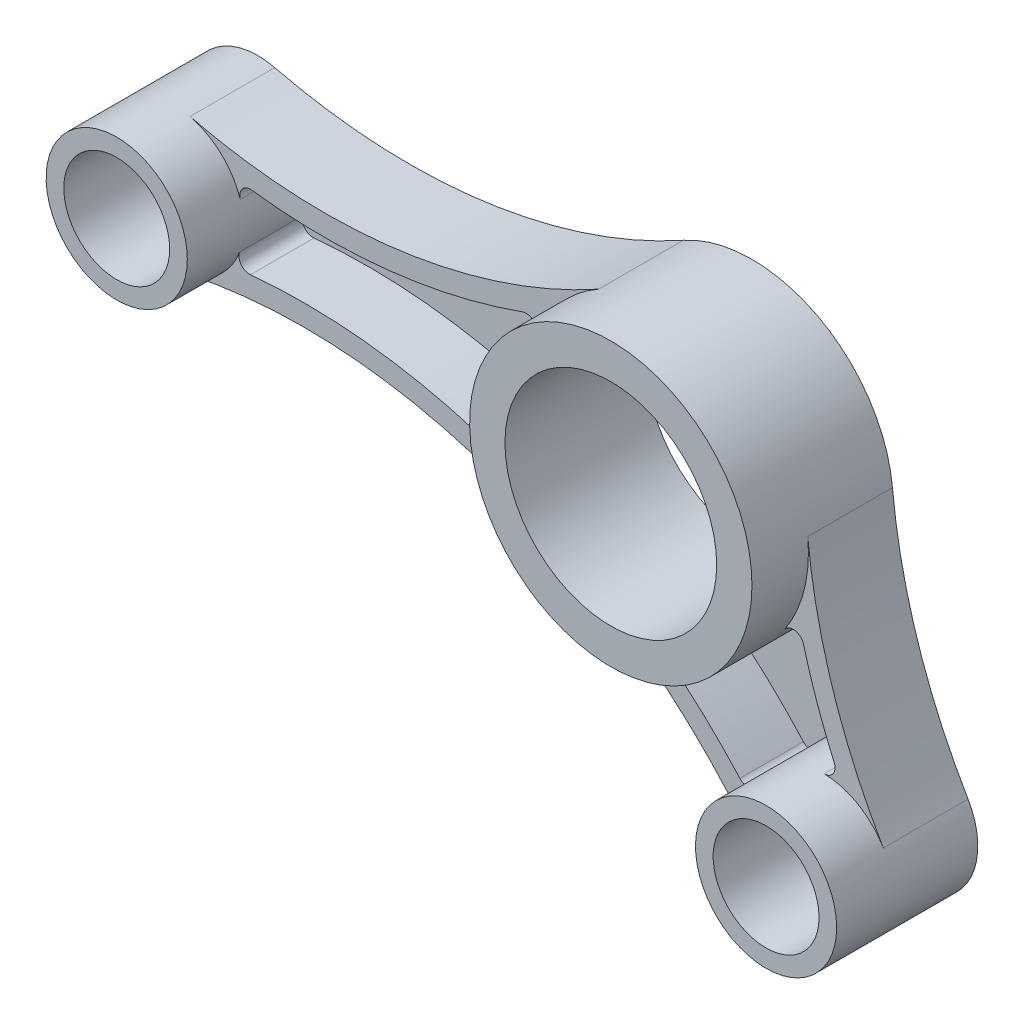
ISO-10303-21;
HEADER;
FILE_DESCRIPTION(('STEP AP214'),'2;1');
FILE_NAME('part.step','',(''),(''),'','','');
FILE_SCHEMA(('AUTOMOTIVE_DESIGN { 1 0 10303 214 1 1 1 1 }'));
ENDSEC;
DATA;
#1=APPLICATION_CONTEXT('core data for automotive mechanical design processes');
#2=APPLICATION_PROTOCOL_DEFINITION('international standard','automotive_design',2000,#1);
#3=PRODUCT_CONTEXT('',#1,'mechanical');
#4=PRODUCT('Part','Part','',(#3));
#5=PRODUCT_RELATED_PRODUCT_CATEGORY('part','',(#4));
#6=PRODUCT_DEFINITION_FORMATION('','',#4);
#7=PRODUCT_DEFINITION_CONTEXT('part definition',#1,'design');
#8=PRODUCT_DEFINITION('design','',#6,#7);
#9=PRODUCT_DEFINITION_SHAPE('','',#8);
#10=(LENGTH_UNIT() NAMED_UNIT(*) SI_UNIT(.MILLI.,.METRE.));
#11=(NAMED_UNIT(*) PLANE_ANGLE_UNIT() SI_UNIT($,.RADIAN.));
#12=(NAMED_UNIT(*) SI_UNIT($,.STERADIAN.) SOLID_ANGLE_UNIT());
#13=UNCERTAINTY_MEASURE_WITH_UNIT(LENGTH_MEASURE(1.E-05),#10,'distance_accuracy_value','');
#14=(GEOMETRIC_REPRESENTATION_CONTEXT(3) GLOBAL_UNCERTAINTY_ASSIGNED_CONTEXT((#13)) GLOBAL_UNIT_ASSIGNED_CONTEXT((#10,
#11,#12)) REPRESENTATION_CONTEXT('',''));
#15=CARTESIAN_POINT('',(0.,0.,0.));
#16=DIRECTION('',(0.,0.,1.));
#17=DIRECTION('',(1.,0.,0.));
#18=AXIS2_PLACEMENT_3D('',#15,#16,#17);
#19=CARTESIAN_POINT('',(0.,0.,20.));
#20=DIRECTION('',(0.,0.,-1.));
#21=DIRECTION('',(-1.,0.,0.));
#22=AXIS2_PLACEMENT_3D('',#19,#20,#21);
#23=CYLINDRICAL_SURFACE('',#22,20.);
#24=CARTESIAN_POINT('',(0.,0.,20.));
#25=DIRECTION('',(0.,0.,1.));
#26=DIRECTION('',(1.,0.,0.));
#27=AXIS2_PLACEMENT_3D('',#24,#25,#26);
#28=CIRCLE('',#27,20.);
#29=CARTESIAN_POINT('',(20.,0.,20.));
#30=VERTEX_POINT('',#29);
#31=EDGE_CURVE('E204',#30,#30,#28,.T.);
#32=ORIENTED_EDGE('',*,*,#31,.F.);
#33=EDGE_LOOP('',(#32));
#34=FACE_BOUND('',#33,.T.);
#35=CARTESIAN_POINT('',(0.,0.,12.));
#36=DIRECTION('',(0.,0.,1.));
#37=DIRECTION('',(1.,0.,0.));
#38=AXIS2_PLACEMENT_3D('',#35,#36,#37);
#39=CIRCLE('',#38,20.);
#40=CARTESIAN_POINT('',(-17.6980518463071,-9.31552257500485,12.));
#41=VERTEX_POINT('',#40);
#42=CARTESIAN_POINT('',(0.586906535940655,-19.9913866632125,12.));
#43=VERTEX_POINT('',#42);
#44=EDGE_CURVE('E251',#41,#43,#39,.T.);
#45=ORIENTED_EDGE('',*,*,#44,.T.);
#46=DIRECTION('',(0.,0.,-1.));
#47=VECTOR('',#46,1.);
#48=CARTESIAN_POINT('',(0.586906535940655,-19.9913866632125,20.));
#49=LINE('',#48,#47);
#50=CARTESIAN_POINT('',(0.586906535940655,-19.9913866632125,3.));
#51=VERTEX_POINT('',#50);
#52=EDGE_CURVE('E375',#43,#51,#49,.T.);
#53=ORIENTED_EDGE('',*,*,#52,.T.);
#54=CARTESIAN_POINT('',(0.,0.,3.));
#55=DIRECTION('',(0.,0.,1.));
#56=DIRECTION('',(1.,0.,0.));
#57=AXIS2_PLACEMENT_3D('',#54,#55,#56);
#58=CIRCLE('',#57,20.);
#59=CARTESIAN_POINT('',(16.6113412774827,-11.1383724557495,3.));
#60=VERTEX_POINT('',#59);
#61=EDGE_CURVE('E503',#51,#60,#58,.T.);
#62=ORIENTED_EDGE('',*,*,#61,.T.);
#63=DIRECTION('',(0.,0.,-1.));
#64=VECTOR('',#63,1.);
#65=CARTESIAN_POINT('',(16.6113412774827,-11.1383724557495,20.));
#66=LINE('',#65,#64);
#67=CARTESIAN_POINT('',(16.6113412774827,-11.1383724557495,12.));
#68=VERTEX_POINT('',#67);
#69=EDGE_CURVE('E372',#60,#68,#66,.F.);
#70=ORIENTED_EDGE('',*,*,#69,.T.);
#71=CARTESIAN_POINT('',(0.,0.,12.));
#72=DIRECTION('',(0.,0.,1.));
#73=DIRECTION('',(1.,0.,0.));
#74=AXIS2_PLACEMENT_3D('',#71,#72,#73);
#75=CIRCLE('',#74,20.);
#76=CARTESIAN_POINT('',(19.9054700055019,1.94223167002899,12.));
#77=VERTEX_POINT('',#76);
#78=EDGE_CURVE('E210',#68,#77,#75,.T.);
#79=ORIENTED_EDGE('',*,*,#78,.T.);
#80=DIRECTION('',(0.,0.,-1.));
#81=VECTOR('',#80,1.);
#82=CARTESIAN_POINT('',(19.9054700055019,1.94223167002899,12.));
#83=LINE('',#82,#81);
#84=CARTESIAN_POINT('',(19.9054700055019,1.94223167002899,0.));
#85=VERTEX_POINT('',#84);
#86=EDGE_CURVE('E208',#77,#85,#83,.T.);
#87=ORIENTED_EDGE('',*,*,#86,.T.);
#88=CARTESIAN_POINT('',(0.,0.,0.));
#89=DIRECTION('',(0.,0.,1.));
#90=DIRECTION('',(1.,0.,0.));
#91=AXIS2_PLACEMENT_3D('',#88,#89,#90);
#92=CIRCLE('',#91,20.);
#93=CARTESIAN_POINT('',(-9.71428571428572,17.4823526180324,0.));
#94=VERTEX_POINT('',#93);
#95=EDGE_CURVE('E191',#85,#94,#92,.T.);
#96=ORIENTED_EDGE('',*,*,#95,.T.);
#97=DIRECTION('',(0.,0.,-1.));
#98=VECTOR('',#97,1.);
#99=CARTESIAN_POINT('',(-9.71428571428572,17.4823526180324,12.));
#100=LINE('',#99,#98);
#101=CARTESIAN_POINT('',(-9.71428571428572,17.4823526180324,12.));
#102=VERTEX_POINT('',#101);
#103=EDGE_CURVE('E312',#102,#94,#100,.T.);
#104=ORIENTED_EDGE('',*,*,#103,.F.);
#105=CARTESIAN_POINT('',(0.,0.,12.));
#106=DIRECTION('',(0.,0.,1.));
#107=DIRECTION('',(1.,0.,0.));
#108=AXIS2_PLACEMENT_3D('',#105,#106,#107);
#109=CIRCLE('',#108,20.);
#110=CARTESIAN_POINT('',(-18.6051659208393,7.33810609476582,12.));
#111=VERTEX_POINT('',#110);
#112=EDGE_CURVE('E299',#102,#111,#109,.T.);
#113=ORIENTED_EDGE('',*,*,#112,.T.);
#114=DIRECTION('',(0.,0.,-1.));
#115=VECTOR('',#114,1.);
#116=CARTESIAN_POINT('',(-18.6051659208393,7.33810609476582,20.));
#117=LINE('',#116,#115);
#118=CARTESIAN_POINT('',(-18.6051659208393,7.33810609476582,3.));
#119=VERTEX_POINT('',#118);
#120=EDGE_CURVE('E364',#111,#119,#117,.T.);
#121=ORIENTED_EDGE('',*,*,#120,.T.);
#122=CARTESIAN_POINT('',(0.,0.,3.));
#123=DIRECTION('',(0.,0.,1.));
#124=DIRECTION('',(1.,0.,0.));
#125=AXIS2_PLACEMENT_3D('',#122,#123,#124);
#126=CIRCLE('',#125,20.);
#127=CARTESIAN_POINT('',(-17.6980518463071,-9.31552257500485,3.));
#128=VERTEX_POINT('',#127);
#129=EDGE_CURVE('E463',#119,#128,#126,.T.);
#130=ORIENTED_EDGE('',*,*,#129,.T.);
#131=DIRECTION('',(0.,0.,-1.));
#132=VECTOR('',#131,1.);
#133=CARTESIAN_POINT('',(-17.6980518463071,-9.31552257500485,20.));
#134=LINE('',#133,#132);
#135=EDGE_CURVE('E368',#128,#41,#134,.F.);
#136=ORIENTED_EDGE('',*,*,#135,.T.);
#137=EDGE_LOOP('',(#45,#53,#62,#70,#79,#87,#96,#104,#113,#121,#130,#136));
#138=FACE_BOUND('',#137,.T.);
#139=ADVANCED_FACE('F41',(#34,#138),#23,.T.);
#140=CARTESIAN_POINT('',(22.,-36.,20.));
#141=DIRECTION('',(0.,0.,-1.));
#142=DIRECTION('',(-1.,0.,0.));
#143=AXIS2_PLACEMENT_3D('',#140,#141,#142);
#144=CYLINDRICAL_SURFACE('',#143,10.);
#145=CARTESIAN_POINT('',(22.,-36.,20.));
#146=DIRECTION('',(0.,0.,1.));
#147=DIRECTION('',(1.,0.,0.));
#148=AXIS2_PLACEMENT_3D('',#145,#146,#147);
#149=CIRCLE('',#148,10.);
#150=CARTESIAN_POINT('',(32.,-36.,20.));
#151=VERTEX_POINT('',#150);
#152=EDGE_CURVE('E235',#151,#151,#149,.T.);
#153=ORIENTED_EDGE('',*,*,#152,.F.);
#154=EDGE_LOOP('',(#153));
#155=FACE_BOUND('',#154,.T.);
#156=CARTESIAN_POINT('',(22.,-36.,3.));
#157=DIRECTION('',(0.,0.,1.));
#158=DIRECTION('',(1.,0.,0.));
#159=AXIS2_PLACEMENT_3D('',#156,#157,#158);
#160=CIRCLE('',#159,10.);
#161=CARTESIAN_POINT('',(22.2294855530443,-26.0026335277262,3.));
#162=VERTEX_POINT('',#161);
#163=CARTESIAN_POINT('',(12.7826897810462,-32.1217023931151,3.));
#164=VERTEX_POINT('',#163);
#165=EDGE_CURVE('E471',#162,#164,#160,.T.);
#166=ORIENTED_EDGE('',*,*,#165,.T.);
#167=DIRECTION('',(0.,0.,-1.));
#168=VECTOR('',#167,1.);
#169=CARTESIAN_POINT('',(12.7826897810462,-32.1217023931151,20.));
#170=LINE('',#169,#168);
#171=CARTESIAN_POINT('',(12.7826897810462,-32.1217023931151,12.));
#172=VERTEX_POINT('',#171);
#173=EDGE_CURVE('E353',#164,#172,#170,.F.);
#174=ORIENTED_EDGE('',*,*,#173,.T.);
#175=CARTESIAN_POINT('',(22.,-36.,12.));
#176=DIRECTION('',(0.,0.,1.));
#177=DIRECTION('',(1.,0.,0.));
#178=AXIS2_PLACEMENT_3D('',#175,#176,#177);
#179=CIRCLE('',#178,10.);
#180=CARTESIAN_POINT('',(13.8427949105964,-41.7844623889699,12.));
#181=VERTEX_POINT('',#180);
#182=EDGE_CURVE('E264',#172,#181,#179,.T.);
#183=ORIENTED_EDGE('',*,*,#182,.T.);
#184=DIRECTION('',(0.,0.,-1.));
#185=VECTOR('',#184,1.);
#186=CARTESIAN_POINT('',(13.8427949105963,-41.7844623889699,12.));
#187=LINE('',#186,#185);
#188=CARTESIAN_POINT('',(13.8427949105963,-41.7844623889699,0.));
#189=VERTEX_POINT('',#188);
#190=EDGE_CURVE('E272',#181,#189,#187,.T.);
#191=ORIENTED_EDGE('',*,*,#190,.T.);
#192=CARTESIAN_POINT('',(22.,-36.,0.));
#193=DIRECTION('',(0.,0.,1.));
#194=DIRECTION('',(1.,0.,0.));
#195=AXIS2_PLACEMENT_3D('',#192,#193,#194);
#196=CIRCLE('',#195,10.);
#197=CARTESIAN_POINT('',(30.6141500030566,-30.9209824055395,0.));
#198=VERTEX_POINT('',#197);
#199=EDGE_CURVE('E236',#189,#198,#196,.T.);
#200=ORIENTED_EDGE('',*,*,#199,.T.);
#201=DIRECTION('',(0.,0.,-1.));
#202=VECTOR('',#201,1.);
#203=CARTESIAN_POINT('',(30.6141500030566,-30.9209824055395,12.));
#204=LINE('',#203,#202);
#205=CARTESIAN_POINT('',(30.6141500030566,-30.9209824055395,12.));
#206=VERTEX_POINT('',#205);
#207=EDGE_CURVE('E215',#206,#198,#204,.T.);
#208=ORIENTED_EDGE('',*,*,#207,.F.);
#209=CARTESIAN_POINT('',(22.,-36.,12.));
#210=DIRECTION('',(0.,0.,1.));
#211=DIRECTION('',(1.,0.,0.));
#212=AXIS2_PLACEMENT_3D('',#209,#210,#211);
#213=CIRCLE('',#212,10.);
#214=CARTESIAN_POINT('',(22.2294855530443,-26.0026335277262,12.));
#215=VERTEX_POINT('',#214);
#216=EDGE_CURVE('E477',#206,#215,#213,.T.);
#217=ORIENTED_EDGE('',*,*,#216,.T.);
#218=DIRECTION('',(0.,0.,-1.));
#219=VECTOR('',#218,1.);
#220=CARTESIAN_POINT('',(22.2294855530443,-26.0026335277262,20.));
#221=LINE('',#220,#219);
#222=EDGE_CURVE('E349',#215,#162,#221,.T.);
#223=ORIENTED_EDGE('',*,*,#222,.T.);
#224=EDGE_LOOP('',(#166,#174,#183,#191,#200,#208,#217,#223));
#225=FACE_BOUND('',#224,.T.);
#226=ADVANCED_FACE('F492',(#155,#225),#144,.T.);
#227=CARTESIAN_POINT('',(-70.,0.,20.));
#228=DIRECTION('',(0.,0.,-1.));
#229=DIRECTION('',(-1.,0.,0.));
#230=AXIS2_PLACEMENT_3D('',#227,#228,#229);
#231=CYLINDRICAL_SURFACE('',#230,9.99999999999999);
#232=CARTESIAN_POINT('',(-70.,0.,20.));
#233=DIRECTION('',(0.,0.,1.));
#234=DIRECTION('',(1.,0.,0.));
#235=AXIS2_PLACEMENT_3D('',#232,#233,#234);
#236=CIRCLE('',#235,9.99999999999999);
#237=CARTESIAN_POINT('',(-60.,0.,20.));
#238=VERTEX_POINT('',#237);
#239=EDGE_CURVE('E320',#238,#238,#236,.T.);
#240=ORIENTED_EDGE('',*,*,#239,.F.);
#241=EDGE_LOOP('',(#240));
#242=FACE_BOUND('',#241,.T.);
#243=CARTESIAN_POINT('',(-70.,0.,12.));
#244=DIRECTION('',(0.,0.,1.));
#245=DIRECTION('',(1.,0.,0.));
#246=AXIS2_PLACEMENT_3D('',#243,#244,#245);
#247=CIRCLE('',#246,9.99999999999999);
#248=CARTESIAN_POINT('',(-67.9349828671814,-9.78446238896985,12.));
#249=VERTEX_POINT('',#248);
#250=CARTESIAN_POINT('',(-60.5984095289481,-3.40735918485657,12.));
#251=VERTEX_POINT('',#250);
#252=EDGE_CURVE('E57',#249,#251,#247,.T.);
#253=ORIENTED_EDGE('',*,*,#252,.T.);
#254=DIRECTION('',(0.,0.,-1.));
#255=VECTOR('',#254,1.);
#256=CARTESIAN_POINT('',(-60.5984095289481,-3.40735918485657,20.));
#257=LINE('',#256,#255);
#258=CARTESIAN_POINT('',(-60.5984095289481,-3.40735918485657,3.));
#259=VERTEX_POINT('',#258);
#260=EDGE_CURVE('E408',#251,#259,#257,.T.);
#261=ORIENTED_EDGE('',*,*,#260,.T.);
#262=CARTESIAN_POINT('',(-70.,0.,3.));
#263=DIRECTION('',(0.,0.,1.));
#264=DIRECTION('',(1.,0.,0.));
#265=AXIS2_PLACEMENT_3D('',#262,#263,#264);
#266=CIRCLE('',#265,9.99999999999999);
#267=CARTESIAN_POINT('',(-60.4929461879507,3.10095595176697,3.));
#268=VERTEX_POINT('',#267);
#269=EDGE_CURVE('E221',#259,#268,#266,.T.);
#270=ORIENTED_EDGE('',*,*,#269,.T.);
#271=DIRECTION('',(0.,0.,-1.));
#272=VECTOR('',#271,1.);
#273=CARTESIAN_POINT('',(-60.4929461879507,3.10095595176697,20.));
#274=LINE('',#273,#272);
#275=CARTESIAN_POINT('',(-60.4929461879507,3.10095595176697,12.));
#276=VERTEX_POINT('',#275);
#277=EDGE_CURVE('E405',#268,#276,#274,.F.);
#278=ORIENTED_EDGE('',*,*,#277,.T.);
#279=CARTESIAN_POINT('',(-70.,0.,12.));
#280=DIRECTION('',(0.,0.,1.));
#281=DIRECTION('',(1.,0.,0.));
#282=AXIS2_PLACEMENT_3D('',#279,#280,#281);
#283=CIRCLE('',#282,9.99999999999999);
#284=CARTESIAN_POINT('',(-67.6190476190476,9.71241812112911,12.));
#285=VERTEX_POINT('',#284);
#286=EDGE_CURVE('E64',#276,#285,#283,.T.);
#287=ORIENTED_EDGE('',*,*,#286,.T.);
#288=DIRECTION('',(0.,0.,-1.));
#289=VECTOR('',#288,1.);
#290=CARTESIAN_POINT('',(-67.6190476190476,9.71241812112911,12.));
#291=LINE('',#290,#289);
#292=CARTESIAN_POINT('',(-67.6190476190476,9.71241812112911,0.));
#293=VERTEX_POINT('',#292);
#294=EDGE_CURVE('E306',#285,#293,#291,.T.);
#295=ORIENTED_EDGE('',*,*,#294,.T.);
#296=CARTESIAN_POINT('',(-70.,0.,0.));
#297=DIRECTION('',(0.,0.,1.));
#298=DIRECTION('',(1.,0.,0.));
#299=AXIS2_PLACEMENT_3D('',#296,#297,#298);
#300=CIRCLE('',#299,9.99999999999999);
#301=CARTESIAN_POINT('',(-67.9349828671814,-9.78446238896985,0.));
#302=VERTEX_POINT('',#301);
#303=EDGE_CURVE('E321',#293,#302,#300,.T.);
#304=ORIENTED_EDGE('',*,*,#303,.T.);
#305=DIRECTION('',(0.,0.,-1.));
#306=VECTOR('',#305,1.);
#307=CARTESIAN_POINT('',(-67.9349828671814,-9.78446238896985,12.));
#308=LINE('',#307,#306);
#309=EDGE_CURVE('E279',#249,#302,#308,.T.);
#310=ORIENTED_EDGE('',*,*,#309,.F.);
#311=EDGE_LOOP('',(#253,#261,#270,#278,#287,#295,#304,#310));
#312=FACE_BOUND('',#311,.T.);
#313=ADVANCED_FACE('F441',(#242,#312),#231,.T.);
#314=CARTESIAN_POINT('',(-70.,0.,20.));
#315=DIRECTION('',(0.,0.,-1.));
#316=DIRECTION('',(-1.,0.,0.));
#317=AXIS2_PLACEMENT_3D('',#314,#315,#316);
#318=CYLINDRICAL_SURFACE('',#317,7.5);
#319=CARTESIAN_POINT('',(-70.,0.,20.));
#320=DIRECTION('',(0.,0.,1.));
#321=DIRECTION('',(1.,0.,0.));
#322=AXIS2_PLACEMENT_3D('',#319,#320,#321);
#323=CIRCLE('',#322,7.5);
#324=CARTESIAN_POINT('',(-62.5,0.,20.));
#325=VERTEX_POINT('',#324);
#326=EDGE_CURVE('E316',#325,#325,#323,.T.);
#327=ORIENTED_EDGE('',*,*,#326,.T.);
#328=EDGE_LOOP('',(#327));
#329=FACE_BOUND('',#328,.T.);
#330=CARTESIAN_POINT('',(-70.,0.,0.));
#331=DIRECTION('',(0.,0.,1.));
#332=DIRECTION('',(1.,0.,0.));
#333=AXIS2_PLACEMENT_3D('',#330,#331,#332);
#334=CIRCLE('',#333,7.5);
#335=CARTESIAN_POINT('',(-62.5,0.,0.));
#336=VERTEX_POINT('',#335);
#337=EDGE_CURVE('E315',#336,#336,#334,.T.);
#338=ORIENTED_EDGE('',*,*,#337,.F.);
#339=EDGE_LOOP('',(#338));
#340=FACE_BOUND('',#339,.T.);
#341=ADVANCED_FACE('F556',(#329,#340),#318,.F.);
#342=CARTESIAN_POINT('',(0.,0.,20.));
#343=DIRECTION('',(0.,0.,1.));
#344=DIRECTION('',(1.,0.,0.));
#345=AXIS2_PLACEMENT_3D('',#342,#343,#344);
#346=PLANE('',#345);
#347=ORIENTED_EDGE('',*,*,#326,.F.);
#348=EDGE_LOOP('',(#347));
#349=FACE_BOUND('',#348,.T.);
#350=ORIENTED_EDGE('',*,*,#239,.T.);
#351=EDGE_LOOP('',(#350));
#352=FACE_BOUND('',#351,.T.);
#353=ADVANCED_FACE('F553',(#349,#352),#346,.T.);
#354=CARTESIAN_POINT('',(0.,0.,0.));
#355=DIRECTION('',(0.,0.,1.));
#356=DIRECTION('',(1.,0.,0.));
#357=AXIS2_PLACEMENT_3D('',#354,#355,#356);
#358=PLANE('',#357);
#359=ORIENTED_EDGE('',*,*,#95,.F.);
#360=CARTESIAN_POINT('',(99.5273500275096,9.71115835014496,0.));
#361=DIRECTION('',(0.,0.,1.));
#362=DIRECTION('',(1.,0.,0.));
#363=AXIS2_PLACEMENT_3D('',#360,#361,#362);
#364=CIRCLE('',#363,80.0000000000001);
#365=EDGE_CURVE('E197',#85,#198,#364,.T.);
#366=ORIENTED_EDGE('',*,*,#365,.T.);
#367=ORIENTED_EDGE('',*,*,#199,.F.);
#368=CARTESIAN_POINT('',(-51.4148458046329,-88.0601615007287,0.));
#369=DIRECTION('',(0.,0.,1.));
#370=DIRECTION('',(1.,0.,0.));
#371=AXIS2_PLACEMENT_3D('',#368,#369,#370);
#372=CIRCLE('',#371,79.9999999999999);
#373=EDGE_CURVE('E244',#189,#302,#372,.T.);
#374=ORIENTED_EDGE('',*,*,#373,.T.);
#375=ORIENTED_EDGE('',*,*,#303,.F.);
#376=CARTESIAN_POINT('',(-48.5714285714286,87.411763090162,0.));
#377=DIRECTION('',(0.,0.,1.));
#378=DIRECTION('',(1.,0.,0.));
#379=AXIS2_PLACEMENT_3D('',#376,#377,#378);
#380=CIRCLE('',#379,80.);
#381=EDGE_CURVE('E199',#293,#94,#380,.T.);
#382=ORIENTED_EDGE('',*,*,#381,.T.);
#383=EDGE_LOOP('',(#359,#366,#367,#374,#375,#382));
#384=FACE_BOUND('',#383,.T.);
#385=ORIENTED_EDGE('',*,*,#337,.T.);
#386=EDGE_LOOP('',(#385));
#387=FACE_BOUND('',#386,.T.);
#388=CARTESIAN_POINT('',(0.,0.,0.));
#389=DIRECTION('',(0.,0.,1.));
#390=DIRECTION('',(1.,0.,0.));
#391=AXIS2_PLACEMENT_3D('',#388,#389,#390);
#392=CIRCLE('',#391,15.);
#393=CARTESIAN_POINT('',(15.,0.,0.));
#394=VERTEX_POINT('',#393);
#395=EDGE_CURVE('E283',#394,#394,#392,.T.);
#396=ORIENTED_EDGE('',*,*,#395,.T.);
#397=EDGE_LOOP('',(#396));
#398=FACE_BOUND('',#397,.T.);
#399=CARTESIAN_POINT('',(22.,-36.,0.));
#400=DIRECTION('',(0.,0.,1.));
#401=DIRECTION('',(1.,0.,0.));
#402=AXIS2_PLACEMENT_3D('',#399,#400,#401);
#403=CIRCLE('',#402,7.5);
#404=CARTESIAN_POINT('',(29.5,-36.,0.));
#405=VERTEX_POINT('',#404);
#406=EDGE_CURVE('E239',#405,#405,#403,.T.);
#407=ORIENTED_EDGE('',*,*,#406,.T.);
#408=EDGE_LOOP('',(#407));
#409=FACE_BOUND('',#408,.T.);
#410=ADVANCED_FACE('F193',(#384,#387,#398,#409),#358,.F.);
#411=CARTESIAN_POINT('',(-48.5714285714286,87.411763090162,12.));
#412=DIRECTION('',(0.,0.,-1.));
#413=DIRECTION('',(-1.,0.,0.));
#414=AXIS2_PLACEMENT_3D('',#411,#412,#413);
#415=CYLINDRICAL_SURFACE('',#414,83.);
#416=CARTESIAN_POINT('',(-48.5714285714286,87.411763090162,3.));
#417=DIRECTION('',(0.,0.,1.));
#418=DIRECTION('',(1.,0.,0.));
#419=AXIS2_PLACEMENT_3D('',#416,#417,#418);
#420=CIRCLE('',#419,83.);
#421=CARTESIAN_POINT('',(-58.8805781833969,5.0544839080639,3.));
#422=VERTEX_POINT('',#421);
#423=CARTESIAN_POINT('',(-20.5077286644264,9.30012024781922,3.));
#424=VERTEX_POINT('',#423);
#425=EDGE_CURVE('E228',#422,#424,#420,.T.);
#426=ORIENTED_EDGE('',*,*,#425,.T.);
#427=DIRECTION('',(0.,0.,-1.));
#428=VECTOR('',#427,1.);
#429=CARTESIAN_POINT('',(-20.5077286644264,9.3001202478192,12.));
#430=LINE('',#429,#428);
#431=CARTESIAN_POINT('',(-20.5077286644264,9.30012024781922,12.));
#432=VERTEX_POINT('',#431);
#433=EDGE_CURVE('E402',#424,#432,#430,.F.);
#434=ORIENTED_EDGE('',*,*,#433,.T.);
#435=CARTESIAN_POINT('',(-48.5714285714286,87.411763090162,12.));
#436=DIRECTION('',(0.,0.,1.));
#437=DIRECTION('',(1.,0.,0.));
#438=AXIS2_PLACEMENT_3D('',#435,#436,#437);
#439=CIRCLE('',#438,83.);
#440=CARTESIAN_POINT('',(-58.8805781833969,5.0544839080639,12.));
#441=VERTEX_POINT('',#440);
#442=EDGE_CURVE('E295',#441,#432,#439,.T.);
#443=ORIENTED_EDGE('',*,*,#442,.F.);
#444=DIRECTION('',(0.,0.,-1.));
#445=VECTOR('',#444,1.);
#446=CARTESIAN_POINT('',(-58.8805781833969,5.0544839080639,12.));
#447=LINE('',#446,#445);
#448=EDGE_CURVE('E398',#441,#422,#447,.T.);
#449=ORIENTED_EDGE('',*,*,#448,.T.);
#450=EDGE_LOOP('',(#426,#434,#443,#449));
#451=FACE_BOUND('',#450,.T.);
#452=ADVANCED_FACE('F454',(#451),#415,.T.);
#453=CARTESIAN_POINT('',(-48.5714285714286,87.411763090162,12.));
#454=DIRECTION('',(0.,0.,-1.));
#455=DIRECTION('',(-1.,0.,0.));
#456=AXIS2_PLACEMENT_3D('',#453,#454,#455);
#457=CYLINDRICAL_SURFACE('',#456,80.);
#458=ORIENTED_EDGE('',*,*,#381,.F.);
#459=ORIENTED_EDGE('',*,*,#294,.F.);
#460=CARTESIAN_POINT('',(-48.5714285714286,87.411763090162,12.));
#461=DIRECTION('',(0.,0.,1.));
#462=DIRECTION('',(1.,0.,0.));
#463=AXIS2_PLACEMENT_3D('',#460,#461,#462);
#464=CIRCLE('',#463,80.);
#465=EDGE_CURVE('E302',#285,#102,#464,.T.);
#466=ORIENTED_EDGE('',*,*,#465,.T.);
#467=ORIENTED_EDGE('',*,*,#103,.T.);
#468=EDGE_LOOP('',(#458,#459,#466,#467));
#469=FACE_BOUND('',#468,.T.);
#470=ADVANCED_FACE('F547',(#469),#457,.F.);
#471=CARTESIAN_POINT('',(0.,0.,12.));
#472=DIRECTION('',(0.,0.,1.));
#473=DIRECTION('',(1.,0.,0.));
#474=AXIS2_PLACEMENT_3D('',#471,#472,#473);
#475=PLANE('',#474);
#476=ORIENTED_EDGE('',*,*,#286,.F.);
#477=CARTESIAN_POINT('',(-59.0668881161433,3.56609934453201,12.));
#478=DIRECTION('',(0.,0.,1.));
#479=DIRECTION('',(1.,0.,0.));
#480=AXIS2_PLACEMENT_3D('',#477,#478,#479);
#481=CIRCLE('',#480,1.5);
#482=EDGE_CURVE('E11',#276,#441,#481,.F.);
#483=ORIENTED_EDGE('',*,*,#482,.T.);
#484=ORIENTED_EDGE('',*,*,#442,.T.);
#485=CARTESIAN_POINT('',(-20.0005533649023,7.88846405187326,12.));
#486=DIRECTION('',(0.,0.,1.));
#487=DIRECTION('',(1.,0.,0.));
#488=AXIS2_PLACEMENT_3D('',#485,#486,#487);
#489=CIRCLE('',#488,1.5);
#490=EDGE_CURVE('E428',#432,#111,#489,.F.);
#491=ORIENTED_EDGE('',*,*,#490,.T.);
#492=ORIENTED_EDGE('',*,*,#112,.F.);
#493=ORIENTED_EDGE('',*,*,#465,.F.);
#494=EDGE_LOOP('',(#476,#483,#484,#491,#492,#493));
#495=FACE_BOUND('',#494,.T.);
#496=ADVANCED_FACE('F457',(#495),#475,.T.);
#497=CARTESIAN_POINT('',(0.,0.,20.));
#498=DIRECTION('',(0.,0.,1.));
#499=DIRECTION('',(1.,0.,0.));
#500=AXIS2_PLACEMENT_3D('',#497,#498,#499);
#501=PLANE('',#500);
#502=CARTESIAN_POINT('',(0.,0.,20.));
#503=DIRECTION('',(0.,0.,1.));
#504=DIRECTION('',(1.,0.,0.));
#505=AXIS2_PLACEMENT_3D('',#502,#503,#504);
#506=CIRCLE('',#505,15.);
#507=CARTESIAN_POINT('',(15.,0.,20.));
#508=VERTEX_POINT('',#507);
#509=EDGE_CURVE('E205',#508,#508,#506,.T.);
#510=ORIENTED_EDGE('',*,*,#509,.F.);
#511=EDGE_LOOP('',(#510));
#512=FACE_BOUND('',#511,.T.);
#513=ORIENTED_EDGE('',*,*,#31,.T.);
#514=EDGE_LOOP('',(#513));
#515=FACE_BOUND('',#514,.T.);
#516=ADVANCED_FACE('F543',(#512,#515),#501,.T.);
#517=CARTESIAN_POINT('',(0.,0.,20.));
#518=DIRECTION('',(0.,0.,-1.));
#519=DIRECTION('',(-1.,0.,0.));
#520=AXIS2_PLACEMENT_3D('',#517,#518,#519);
#521=CYLINDRICAL_SURFACE('',#520,15.);
#522=ORIENTED_EDGE('',*,*,#509,.T.);
#523=EDGE_LOOP('',(#522));
#524=FACE_BOUND('',#523,.T.);
#525=ORIENTED_EDGE('',*,*,#395,.F.);
#526=EDGE_LOOP('',(#525));
#527=FACE_BOUND('',#526,.T.);
#528=ADVANCED_FACE('F693',(#524,#527),#521,.F.);
#529=CARTESIAN_POINT('',(-51.4148458046329,-88.0601615007287,12.));
#530=DIRECTION('',(0.,0.,-1.));
#531=DIRECTION('',(-1.,0.,0.));
#532=AXIS2_PLACEMENT_3D('',#529,#530,#531);
#533=CYLINDRICAL_SURFACE('',#532,83.);
#534=CARTESIAN_POINT('',(-51.4148458046329,-88.0601615007287,12.));
#535=DIRECTION('',(0.,0.,1.));
#536=DIRECTION('',(1.,0.,0.));
#537=AXIS2_PLACEMENT_3D('',#534,#535,#536);
#538=CIRCLE('',#537,83.);
#539=CARTESIAN_POINT('',(-19.6003662093929,-11.3996182722592,12.));
#540=VERTEX_POINT('',#539);
#541=CARTESIAN_POINT('',(-59.0501829378112,-5.41210267983021,12.));
#542=VERTEX_POINT('',#541);
#543=EDGE_CURVE('E254',#540,#542,#538,.T.);
#544=ORIENTED_EDGE('',*,*,#543,.F.);
#545=DIRECTION('',(0.,0.,-1.));
#546=VECTOR('',#545,1.);
#547=CARTESIAN_POINT('',(-19.6003662093929,-11.3996182722592,12.));
#548=LINE('',#547,#546);
#549=CARTESIAN_POINT('',(-19.6003662093929,-11.3996182722592,3.));
#550=VERTEX_POINT('',#549);
#551=EDGE_CURVE('E382',#540,#550,#548,.T.);
#552=ORIENTED_EDGE('',*,*,#551,.T.);
#553=CARTESIAN_POINT('',(-51.4148458046329,-88.0601615007287,3.));
#554=DIRECTION('',(0.,0.,1.));
#555=DIRECTION('',(1.,0.,0.));
#556=AXIS2_PLACEMENT_3D('',#553,#554,#555);
#557=CIRCLE('',#556,83.);
#558=CARTESIAN_POINT('',(-59.0501829378112,-5.41210267983021,3.));
#559=VERTEX_POINT('',#558);
#560=EDGE_CURVE('E466',#550,#559,#557,.T.);
#561=ORIENTED_EDGE('',*,*,#560,.T.);
#562=DIRECTION('',(0.,0.,-1.));
#563=VECTOR('',#562,1.);
#564=CARTESIAN_POINT('',(-59.0501829378112,-5.41210267983021,12.));
#565=LINE('',#564,#563);
#566=EDGE_CURVE('E379',#559,#542,#565,.F.);
#567=ORIENTED_EDGE('',*,*,#566,.T.);
#568=EDGE_LOOP('',(#544,#552,#561,#567));
#569=FACE_BOUND('',#568,.T.);
#570=ADVANCED_FACE('F688',(#569),#533,.T.);
#571=CARTESIAN_POINT('',(-51.4148458046329,-88.0601615007287,12.));
#572=DIRECTION('',(0.,0.,-1.));
#573=DIRECTION('',(-1.,0.,0.));
#574=AXIS2_PLACEMENT_3D('',#571,#572,#573);
#575=CYLINDRICAL_SURFACE('',#574,79.9999999999999);
#576=ORIENTED_EDGE('',*,*,#373,.F.);
#577=ORIENTED_EDGE('',*,*,#190,.F.);
#578=CARTESIAN_POINT('',(-51.4148458046329,-88.0601615007287,12.));
#579=DIRECTION('',(0.,0.,1.));
#580=DIRECTION('',(1.,0.,0.));
#581=AXIS2_PLACEMENT_3D('',#578,#579,#580);
#582=CIRCLE('',#581,79.9999999999999);
#583=EDGE_CURVE('E260',#181,#249,#582,.T.);
#584=ORIENTED_EDGE('',*,*,#583,.T.);
#585=ORIENTED_EDGE('',*,*,#309,.T.);
#586=EDGE_LOOP('',(#576,#577,#584,#585));
#587=FACE_BOUND('',#586,.T.);
#588=ADVANCED_FACE('F692',(#587),#575,.F.);
#589=CARTESIAN_POINT('',(-51.4148458046329,-88.0601615007287,12.));
#590=DIRECTION('',(0.,0.,-1.));
#591=DIRECTION('',(-1.,0.,0.));
#592=AXIS2_PLACEMENT_3D('',#589,#590,#591);
#593=CYLINDRICAL_SURFACE('',#592,83.);
#594=CARTESIAN_POINT('',(-51.4148458046329,-88.0601615007287,12.));
#595=DIRECTION('',(0.,0.,1.));
#596=DIRECTION('',(1.,0.,0.));
#597=AXIS2_PLACEMENT_3D('',#594,#595,#596);
#598=CIRCLE('',#597,83.);
#599=CARTESIAN_POINT('',(10.2850351585078,-32.5432749783897,12.));
#600=VERTEX_POINT('',#599);
#601=CARTESIAN_POINT('',(-0.292964888019484,-22.6724463582986,12.));
#602=VERTEX_POINT('',#601);
#603=EDGE_CURVE('E268',#600,#602,#598,.T.);
#604=ORIENTED_EDGE('',*,*,#603,.F.);
#605=DIRECTION('',(0.,0.,-1.));
#606=VECTOR('',#605,1.);
#607=CARTESIAN_POINT('',(10.2850351585078,-32.5432749783897,12.));
#608=LINE('',#607,#606);
#609=CARTESIAN_POINT('',(10.2850351585078,-32.5432749783897,3.));
#610=VERTEX_POINT('',#609);
#611=EDGE_CURVE('E333',#600,#610,#608,.T.);
#612=ORIENTED_EDGE('',*,*,#611,.T.);
#613=CARTESIAN_POINT('',(-51.4148458046329,-88.0601615007287,3.));
#614=DIRECTION('',(0.,0.,1.));
#615=DIRECTION('',(1.,0.,0.));
#616=AXIS2_PLACEMENT_3D('',#613,#614,#615);
#617=CIRCLE('',#616,83.);
#618=CARTESIAN_POINT('',(-0.292964888019484,-22.6724463582986,3.));
#619=VERTEX_POINT('',#618);
#620=EDGE_CURVE('E500',#610,#619,#617,.T.);
#621=ORIENTED_EDGE('',*,*,#620,.T.);
#622=DIRECTION('',(0.,0.,-1.));
#623=VECTOR('',#622,1.);
#624=CARTESIAN_POINT('',(-0.292964888019456,-22.6724463582985,12.));
#625=LINE('',#624,#623);
#626=EDGE_CURVE('E325',#619,#602,#625,.F.);
#627=ORIENTED_EDGE('',*,*,#626,.T.);
#628=EDGE_LOOP('',(#604,#612,#621,#627));
#629=FACE_BOUND('',#628,.T.);
#630=ADVANCED_FACE('F702',(#629),#593,.T.);
#631=CARTESIAN_POINT('',(0.,0.,12.));
#632=DIRECTION('',(0.,0.,1.));
#633=DIRECTION('',(1.,0.,0.));
#634=AXIS2_PLACEMENT_3D('',#631,#632,#633);
#635=PLANE('',#634);
#636=ORIENTED_EDGE('',*,*,#44,.F.);
#637=CARTESIAN_POINT('',(-19.0254057347801,-10.0141867681302,12.));
#638=DIRECTION('',(0.,0.,1.));
#639=DIRECTION('',(1.,0.,0.));
#640=AXIS2_PLACEMENT_3D('',#637,#638,#639);
#641=CIRCLE('',#640,1.5);
#642=EDGE_CURVE('E425',#41,#540,#641,.F.);
#643=ORIENTED_EDGE('',*,*,#642,.T.);
#644=ORIENTED_EDGE('',*,*,#543,.T.);
#645=CARTESIAN_POINT('',(-59.1881709582903,-3.91846306258505,12.));
#646=DIRECTION('',(0.,0.,1.));
#647=DIRECTION('',(1.,0.,0.));
#648=AXIS2_PLACEMENT_3D('',#645,#646,#647);
#649=CIRCLE('',#648,1.5);
#650=EDGE_CURVE('E50',#542,#251,#649,.F.);
#651=ORIENTED_EDGE('',*,*,#650,.T.);
#652=ORIENTED_EDGE('',*,*,#252,.F.);
#653=ORIENTED_EDGE('',*,*,#583,.F.);
#654=ORIENTED_EDGE('',*,*,#182,.F.);
#655=CARTESIAN_POINT('',(11.4000932482031,-31.5399577520824,12.));
#656=DIRECTION('',(0.,0.,1.));
#657=DIRECTION('',(1.,0.,0.));
#658=AXIS2_PLACEMENT_3D('',#655,#656,#657);
#659=CIRCLE('',#658,1.5);
#660=EDGE_CURVE('E411',#172,#600,#659,.F.);
#661=ORIENTED_EDGE('',*,*,#660,.T.);
#662=ORIENTED_EDGE('',*,*,#603,.T.);
#663=CARTESIAN_POINT('',(0.630924526136204,-21.4907406629534,12.));
#664=DIRECTION('',(0.,0.,1.));
#665=DIRECTION('',(1.,0.,0.));
#666=AXIS2_PLACEMENT_3D('',#663,#664,#665);
#667=CIRCLE('',#666,1.5);
#668=EDGE_CURVE('E418',#602,#43,#667,.F.);
#669=ORIENTED_EDGE('',*,*,#668,.T.);
#670=EDGE_LOOP('',(#636,#643,#644,#651,#652,#653,#654,#661,#662,#669));
#671=FACE_BOUND('',#670,.T.);
#672=ADVANCED_FACE('F435',(#671),#635,.T.);
#673=CARTESIAN_POINT('',(22.,-36.,20.));
#674=DIRECTION('',(0.,0.,-1.));
#675=DIRECTION('',(-1.,0.,0.));
#676=AXIS2_PLACEMENT_3D('',#673,#674,#675);
#677=CYLINDRICAL_SURFACE('',#676,7.5);
#678=CARTESIAN_POINT('',(22.,-36.,20.));
#679=DIRECTION('',(0.,0.,1.));
#680=DIRECTION('',(1.,0.,0.));
#681=AXIS2_PLACEMENT_3D('',#678,#679,#680);
#682=CIRCLE('',#681,7.5);
#683=CARTESIAN_POINT('',(29.5,-36.,20.));
#684=VERTEX_POINT('',#683);
#685=EDGE_CURVE('E240',#684,#684,#682,.T.);
#686=ORIENTED_EDGE('',*,*,#685,.T.);
#687=EDGE_LOOP('',(#686));
#688=FACE_BOUND('',#687,.T.);
#689=ORIENTED_EDGE('',*,*,#406,.F.);
#690=EDGE_LOOP('',(#689));
#691=FACE_BOUND('',#690,.T.);
#692=ADVANCED_FACE('F716',(#688,#691),#677,.F.);
#693=CARTESIAN_POINT('',(0.,0.,20.));
#694=DIRECTION('',(0.,0.,1.));
#695=DIRECTION('',(1.,0.,0.));
#696=AXIS2_PLACEMENT_3D('',#693,#694,#695);
#697=PLANE('',#696);
#698=ORIENTED_EDGE('',*,*,#685,.F.);
#699=EDGE_LOOP('',(#698));
#700=FACE_BOUND('',#699,.T.);
#701=ORIENTED_EDGE('',*,*,#152,.T.);
#702=EDGE_LOOP('',(#701));
#703=FACE_BOUND('',#702,.T.);
#704=ADVANCED_FACE('F725',(#700,#703),#697,.T.);
#705=CARTESIAN_POINT('',(99.5273500275096,9.71115835014496,12.));
#706=DIRECTION('',(0.,0.,-1.));
#707=DIRECTION('',(-1.,0.,0.));
#708=AXIS2_PLACEMENT_3D('',#705,#706,#707);
#709=CYLINDRICAL_SURFACE('',#708,83.0000000000001);
#710=CARTESIAN_POINT('',(99.5273500275096,9.71115835014496,3.));
#711=DIRECTION('',(0.,0.,1.));
#712=DIRECTION('',(1.,0.,0.));
#713=AXIS2_PLACEMENT_3D('',#710,#711,#712);
#714=CIRCLE('',#713,83.0000000000001);
#715=CARTESIAN_POINT('',(19.3069579943747,-11.588811181527,3.));
#716=VERTEX_POINT('',#715);
#717=CARTESIAN_POINT('',(23.6354487701697,-23.8956761265829,3.));
#718=VERTEX_POINT('',#717);
#719=EDGE_CURVE('E509',#716,#718,#714,.T.);
#720=ORIENTED_EDGE('',*,*,#719,.T.);
#721=DIRECTION('',(0.,0.,-1.));
#722=VECTOR('',#721,1.);
#723=CARTESIAN_POINT('',(23.6354487701697,-23.8956761265829,12.));
#724=LINE('',#723,#722);
#725=CARTESIAN_POINT('',(23.6354487701697,-23.8956761265829,12.));
#726=VERTEX_POINT('',#725);
#727=EDGE_CURVE('E361',#718,#726,#724,.F.);
#728=ORIENTED_EDGE('',*,*,#727,.T.);
#729=CARTESIAN_POINT('',(99.5273500275096,9.71115835014496,12.));
#730=DIRECTION('',(0.,0.,1.));
#731=DIRECTION('',(1.,0.,0.));
#732=AXIS2_PLACEMENT_3D('',#729,#730,#731);
#733=CIRCLE('',#732,83.0000000000001);
#734=CARTESIAN_POINT('',(19.3069579943747,-11.588811181527,12.));
#735=VERTEX_POINT('',#734);
#736=EDGE_CURVE('E225',#735,#726,#733,.T.);
#737=ORIENTED_EDGE('',*,*,#736,.F.);
#738=DIRECTION('',(0.,0.,-1.));
#739=VECTOR('',#738,1.);
#740=CARTESIAN_POINT('',(19.3069579943747,-11.588811181527,12.));
#741=LINE('',#740,#739);
#742=EDGE_CURVE('E357',#735,#716,#741,.T.);
#743=ORIENTED_EDGE('',*,*,#742,.T.);
#744=EDGE_LOOP('',(#720,#728,#737,#743));
#745=FACE_BOUND('',#744,.T.);
#746=ADVANCED_FACE('F512',(#745),#709,.T.);
#747=CARTESIAN_POINT('',(99.5273500275096,9.71115835014496,12.));
#748=DIRECTION('',(0.,0.,-1.));
#749=DIRECTION('',(-1.,0.,0.));
#750=AXIS2_PLACEMENT_3D('',#747,#748,#749);
#751=CYLINDRICAL_SURFACE('',#750,80.0000000000001);
#752=ORIENTED_EDGE('',*,*,#365,.F.);
#753=ORIENTED_EDGE('',*,*,#86,.F.);
#754=CARTESIAN_POINT('',(99.5273500275096,9.71115835014496,12.));
#755=DIRECTION('',(0.,0.,1.));
#756=DIRECTION('',(1.,0.,0.));
#757=AXIS2_PLACEMENT_3D('',#754,#755,#756);
#758=CIRCLE('',#757,80.0000000000001);
#759=EDGE_CURVE('E216',#77,#206,#758,.T.);
#760=ORIENTED_EDGE('',*,*,#759,.T.);
#761=ORIENTED_EDGE('',*,*,#207,.T.);
#762=EDGE_LOOP('',(#752,#753,#760,#761));
#763=FACE_BOUND('',#762,.T.);
#764=ADVANCED_FACE('F219',(#763),#751,.F.);
#765=CARTESIAN_POINT('',(0.,0.,12.));
#766=DIRECTION('',(0.,0.,1.));
#767=DIRECTION('',(1.,0.,0.));
#768=AXIS2_PLACEMENT_3D('',#765,#766,#767);
#769=PLANE('',#768);
#770=ORIENTED_EDGE('',*,*,#78,.F.);
#771=CARTESIAN_POINT('',(17.8571918732939,-11.9737503899307,12.));
#772=DIRECTION('',(0.,0.,1.));
#773=DIRECTION('',(1.,0.,0.));
#774=AXIS2_PLACEMENT_3D('',#771,#772,#773);
#775=CIRCLE('',#774,1.5);
#776=EDGE_CURVE('E422',#68,#735,#775,.F.);
#777=ORIENTED_EDGE('',*,*,#776,.T.);
#778=ORIENTED_EDGE('',*,*,#736,.T.);
#779=CARTESIAN_POINT('',(22.2639083860009,-24.5030285568852,12.));
#780=DIRECTION('',(0.,0.,1.));
#781=DIRECTION('',(1.,0.,0.));
#782=AXIS2_PLACEMENT_3D('',#779,#780,#781);
#783=CIRCLE('',#782,1.5);
#784=EDGE_CURVE('E414',#726,#215,#783,.F.);
#785=ORIENTED_EDGE('',*,*,#784,.T.);
#786=ORIENTED_EDGE('',*,*,#216,.F.);
#787=ORIENTED_EDGE('',*,*,#759,.F.);
#788=EDGE_LOOP('',(#770,#777,#778,#785,#786,#787));
#789=FACE_BOUND('',#788,.T.);
#790=ADVANCED_FACE('F483',(#789),#769,.T.);
#791=CARTESIAN_POINT('',(0.,0.,3.));
#792=DIRECTION('',(0.,0.,1.));
#793=DIRECTION('',(1.,0.,0.));
#794=AXIS2_PLACEMENT_3D('',#791,#792,#793);
#795=PLANE('',#794);
#796=ORIENTED_EDGE('',*,*,#560,.F.);
#797=CARTESIAN_POINT('',(-19.0254057347801,-10.0141867681302,3.));
#798=DIRECTION('',(0.,0.,1.));
#799=DIRECTION('',(1.,0.,0.));
#800=AXIS2_PLACEMENT_3D('',#797,#798,#799);
#801=CIRCLE('',#800,1.5);
#802=EDGE_CURVE('E395',#550,#128,#801,.T.);
#803=ORIENTED_EDGE('',*,*,#802,.T.);
#804=ORIENTED_EDGE('',*,*,#129,.F.);
#805=CARTESIAN_POINT('',(-20.0005533649023,7.88846405187326,3.));
#806=DIRECTION('',(0.,0.,1.));
#807=DIRECTION('',(1.,0.,0.));
#808=AXIS2_PLACEMENT_3D('',#805,#806,#807);
#809=CIRCLE('',#808,1.5);
#810=EDGE_CURVE('E392',#119,#424,#809,.T.);
#811=ORIENTED_EDGE('',*,*,#810,.T.);
#812=ORIENTED_EDGE('',*,*,#425,.F.);
#813=CARTESIAN_POINT('',(-59.0668881161433,3.56609934453201,3.));
#814=DIRECTION('',(0.,0.,1.));
#815=DIRECTION('',(1.,0.,0.));
#816=AXIS2_PLACEMENT_3D('',#813,#814,#815);
#817=CIRCLE('',#816,1.5);
#818=EDGE_CURVE('E386',#422,#268,#817,.T.);
#819=ORIENTED_EDGE('',*,*,#818,.T.);
#820=ORIENTED_EDGE('',*,*,#269,.F.);
#821=CARTESIAN_POINT('',(-59.1881709582903,-3.91846306258505,3.));
#822=DIRECTION('',(0.,0.,1.));
#823=DIRECTION('',(1.,0.,0.));
#824=AXIS2_PLACEMENT_3D('',#821,#822,#823);
#825=CIRCLE('',#824,1.5);
#826=EDGE_CURVE('E389',#259,#559,#825,.T.);
#827=ORIENTED_EDGE('',*,*,#826,.T.);
#828=EDGE_LOOP('',(#796,#803,#804,#811,#812,#819,#820,#827));
#829=FACE_BOUND('',#828,.T.);
#830=ADVANCED_FACE('F445',(#829),#795,.T.);
#831=CARTESIAN_POINT('',(0.,0.,3.));
#832=DIRECTION('',(0.,0.,1.));
#833=DIRECTION('',(1.,0.,0.));
#834=AXIS2_PLACEMENT_3D('',#831,#832,#833);
#835=PLANE('',#834);
#836=ORIENTED_EDGE('',*,*,#620,.F.);
#837=CARTESIAN_POINT('',(11.4000932482031,-31.5399577520824,3.));
#838=DIRECTION('',(0.,0.,1.));
#839=DIRECTION('',(1.,0.,0.));
#840=AXIS2_PLACEMENT_3D('',#837,#838,#839);
#841=CIRCLE('',#840,1.5);
#842=EDGE_CURVE('E346',#610,#164,#841,.T.);
#843=ORIENTED_EDGE('',*,*,#842,.T.);
#844=ORIENTED_EDGE('',*,*,#165,.F.);
#845=CARTESIAN_POINT('',(22.2639083860009,-24.5030285568852,3.));
#846=DIRECTION('',(0.,0.,1.));
#847=DIRECTION('',(1.,0.,0.));
#848=AXIS2_PLACEMENT_3D('',#845,#846,#847);
#849=CIRCLE('',#848,1.5);
#850=EDGE_CURVE('E343',#162,#718,#849,.T.);
#851=ORIENTED_EDGE('',*,*,#850,.T.);
#852=ORIENTED_EDGE('',*,*,#719,.F.);
#853=CARTESIAN_POINT('',(17.8571918732939,-11.9737503899307,3.));
#854=DIRECTION('',(0.,0.,1.));
#855=DIRECTION('',(1.,0.,0.));
#856=AXIS2_PLACEMENT_3D('',#853,#854,#855);
#857=CIRCLE('',#856,1.5);
#858=EDGE_CURVE('E337',#716,#60,#857,.T.);
#859=ORIENTED_EDGE('',*,*,#858,.T.);
#860=ORIENTED_EDGE('',*,*,#61,.F.);
#861=CARTESIAN_POINT('',(0.630924526136204,-21.4907406629534,3.));
#862=DIRECTION('',(0.,0.,1.));
#863=DIRECTION('',(1.,0.,0.));
#864=AXIS2_PLACEMENT_3D('',#861,#862,#863);
#865=CIRCLE('',#864,1.5);
#866=EDGE_CURVE('E340',#51,#619,#865,.T.);
#867=ORIENTED_EDGE('',*,*,#866,.T.);
#868=EDGE_LOOP('',(#836,#843,#844,#851,#852,#859,#860,#867));
#869=FACE_BOUND('',#868,.T.);
#870=ADVANCED_FACE('F496',(#869),#835,.T.);
#871=CARTESIAN_POINT('',(11.4000932482031,-31.5399577520824,20.));
#872=DIRECTION('',(0.,0.,1.));
#873=DIRECTION('',(1.,0.,0.));
#874=AXIS2_PLACEMENT_3D('',#871,#872,#873);
#875=CYLINDRICAL_SURFACE('',#874,1.5);
#876=ORIENTED_EDGE('',*,*,#660,.F.);
#877=ORIENTED_EDGE('',*,*,#173,.F.);
#878=ORIENTED_EDGE('',*,*,#842,.F.);
#879=ORIENTED_EDGE('',*,*,#611,.F.);
#880=EDGE_LOOP('',(#876,#877,#878,#879));
#881=FACE_BOUND('',#880,.T.);
#882=ADVANCED_FACE('F566',(#881),#875,.F.);
#883=CARTESIAN_POINT('',(22.2639083860009,-24.5030285568852,12.));
#884=DIRECTION('',(0.,0.,1.));
#885=DIRECTION('',(1.,0.,0.));
#886=AXIS2_PLACEMENT_3D('',#883,#884,#885);
#887=CYLINDRICAL_SURFACE('',#886,1.5);
#888=ORIENTED_EDGE('',*,*,#784,.F.);
#889=ORIENTED_EDGE('',*,*,#727,.F.);
#890=ORIENTED_EDGE('',*,*,#850,.F.);
#891=ORIENTED_EDGE('',*,*,#222,.F.);
#892=EDGE_LOOP('',(#888,#889,#890,#891));
#893=FACE_BOUND('',#892,.T.);
#894=ADVANCED_FACE('F489',(#893),#887,.F.);
#895=CARTESIAN_POINT('',(0.630924526136204,-21.4907406629534,12.));
#896=DIRECTION('',(0.,0.,1.));
#897=DIRECTION('',(1.,0.,0.));
#898=AXIS2_PLACEMENT_3D('',#895,#896,#897);
#899=CYLINDRICAL_SURFACE('',#898,1.5);
#900=ORIENTED_EDGE('',*,*,#668,.F.);
#901=ORIENTED_EDGE('',*,*,#626,.F.);
#902=ORIENTED_EDGE('',*,*,#866,.F.);
#903=ORIENTED_EDGE('',*,*,#52,.F.);
#904=EDGE_LOOP('',(#900,#901,#902,#903));
#905=FACE_BOUND('',#904,.T.);
#906=ADVANCED_FACE('F522',(#905),#899,.F.);
#907=CARTESIAN_POINT('',(17.8571918732939,-11.9737503899307,20.));
#908=DIRECTION('',(0.,0.,1.));
#909=DIRECTION('',(1.,0.,0.));
#910=AXIS2_PLACEMENT_3D('',#907,#908,#909);
#911=CYLINDRICAL_SURFACE('',#910,1.5);
#912=ORIENTED_EDGE('',*,*,#776,.F.);
#913=ORIENTED_EDGE('',*,*,#69,.F.);
#914=ORIENTED_EDGE('',*,*,#858,.F.);
#915=ORIENTED_EDGE('',*,*,#742,.F.);
#916=EDGE_LOOP('',(#912,#913,#914,#915));
#917=FACE_BOUND('',#916,.T.);
#918=ADVANCED_FACE('F519',(#917),#911,.F.);
#919=CARTESIAN_POINT('',(-19.0254057347801,-10.0141867681302,20.));
#920=DIRECTION('',(0.,0.,1.));
#921=DIRECTION('',(1.,0.,0.));
#922=AXIS2_PLACEMENT_3D('',#919,#920,#921);
#923=CYLINDRICAL_SURFACE('',#922,1.5);
#924=ORIENTED_EDGE('',*,*,#642,.F.);
#925=ORIENTED_EDGE('',*,*,#135,.F.);
#926=ORIENTED_EDGE('',*,*,#802,.F.);
#927=ORIENTED_EDGE('',*,*,#551,.F.);
#928=EDGE_LOOP('',(#924,#925,#926,#927));
#929=FACE_BOUND('',#928,.T.);
#930=ADVANCED_FACE('F521',(#929),#923,.F.);
#931=CARTESIAN_POINT('',(-20.0005533649023,7.88846405187326,12.));
#932=DIRECTION('',(0.,0.,1.));
#933=DIRECTION('',(1.,0.,0.));
#934=AXIS2_PLACEMENT_3D('',#931,#932,#933);
#935=CYLINDRICAL_SURFACE('',#934,1.5);
#936=ORIENTED_EDGE('',*,*,#490,.F.);
#937=ORIENTED_EDGE('',*,*,#433,.F.);
#938=ORIENTED_EDGE('',*,*,#810,.F.);
#939=ORIENTED_EDGE('',*,*,#120,.F.);
#940=EDGE_LOOP('',(#936,#937,#938,#939));
#941=FACE_BOUND('',#940,.T.);
#942=ADVANCED_FACE('F460',(#941),#935,.F.);
#943=CARTESIAN_POINT('',(-59.1881709582903,-3.91846306258505,12.));
#944=DIRECTION('',(0.,0.,1.));
#945=DIRECTION('',(1.,0.,0.));
#946=AXIS2_PLACEMENT_3D('',#943,#944,#945);
#947=CYLINDRICAL_SURFACE('',#946,1.5);
#948=ORIENTED_EDGE('',*,*,#650,.F.);
#949=ORIENTED_EDGE('',*,*,#566,.F.);
#950=ORIENTED_EDGE('',*,*,#826,.F.);
#951=ORIENTED_EDGE('',*,*,#260,.F.);
#952=EDGE_LOOP('',(#948,#949,#950,#951));
#953=FACE_BOUND('',#952,.T.);
#954=ADVANCED_FACE('F439',(#953),#947,.F.);
#955=CARTESIAN_POINT('',(-59.0668881161433,3.56609934453201,20.));
#956=DIRECTION('',(0.,0.,1.));
#957=DIRECTION('',(1.,0.,0.));
#958=AXIS2_PLACEMENT_3D('',#955,#956,#957);
#959=CYLINDRICAL_SURFACE('',#958,1.5);
#960=ORIENTED_EDGE('',*,*,#482,.F.);
#961=ORIENTED_EDGE('',*,*,#277,.F.);
#962=ORIENTED_EDGE('',*,*,#818,.F.);
#963=ORIENTED_EDGE('',*,*,#448,.F.);
#964=EDGE_LOOP('',(#960,#961,#962,#963));
#965=FACE_BOUND('',#964,.T.);
#966=ADVANCED_FACE('F43',(#965),#959,.F.);
#967=CLOSED_SHELL('',(#139,#226,#313,#341,#353,#410,#452,#470,#496,#516,#528,#570,#588,#630,
#672,#692,#704,#746,#764,#790,#830,#870,#882,#894,#906,#918,#930,#942,#954,#966));
#968=MANIFOLD_SOLID_BREP('B2',#967);
#969=ADVANCED_BREP_SHAPE_REPRESENTATION('',(#18,#968),#14);
#970=SHAPE_DEFINITION_REPRESENTATION(#9,#969);
ENDSEC;
END-ISO-10303-21;
